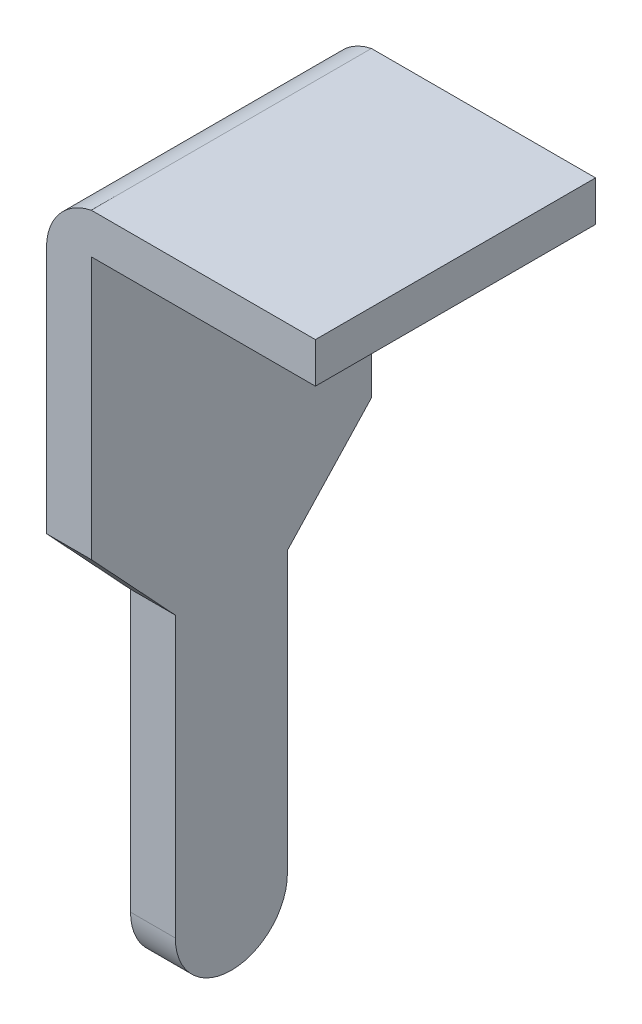
ISO-10303-21;
HEADER;
FILE_DESCRIPTION(('STEP AP214'),'2;1');
FILE_NAME('part.step','',(''),(''),'','','');
FILE_SCHEMA(('AUTOMOTIVE_DESIGN { 1 0 10303 214 1 1 1 1 }'));
ENDSEC;
DATA;
#1=APPLICATION_CONTEXT('core data for automotive mechanical design processes');
#2=APPLICATION_PROTOCOL_DEFINITION('international standard','automotive_design',2000,#1);
#3=PRODUCT_CONTEXT('',#1,'mechanical');
#4=PRODUCT('Part','Part','',(#3));
#5=PRODUCT_RELATED_PRODUCT_CATEGORY('part','',(#4));
#6=PRODUCT_DEFINITION_FORMATION('','',#4);
#7=PRODUCT_DEFINITION_CONTEXT('part definition',#1,'design');
#8=PRODUCT_DEFINITION('design','',#6,#7);
#9=PRODUCT_DEFINITION_SHAPE('','',#8);
#10=(LENGTH_UNIT() NAMED_UNIT(*) SI_UNIT(.MILLI.,.METRE.));
#11=(NAMED_UNIT(*) PLANE_ANGLE_UNIT() SI_UNIT($,.RADIAN.));
#12=(NAMED_UNIT(*) SI_UNIT($,.STERADIAN.) SOLID_ANGLE_UNIT());
#13=UNCERTAINTY_MEASURE_WITH_UNIT(LENGTH_MEASURE(1.E-05),#10,'distance_accuracy_value','');
#14=(GEOMETRIC_REPRESENTATION_CONTEXT(3) GLOBAL_UNCERTAINTY_ASSIGNED_CONTEXT((#13)) GLOBAL_UNIT_ASSIGNED_CONTEXT((#10,
#11,#12)) REPRESENTATION_CONTEXT('',''));
#15=CARTESIAN_POINT('',(0.,0.,0.));
#16=DIRECTION('',(0.,0.,1.));
#17=DIRECTION('',(1.,0.,0.));
#18=AXIS2_PLACEMENT_3D('',#15,#16,#17);
#19=CARTESIAN_POINT('',(-2.5,3.,4.25));
#20=DIRECTION('',(0.,-1.,0.));
#21=DIRECTION('',(0.,0.,-1.));
#22=AXIS2_PLACEMENT_3D('',#19,#20,#21);
#23=PLANE('',#22);
#24=DIRECTION('',(-1.,0.,0.));
#25=VECTOR('',#24,1.);
#26=CARTESIAN_POINT('',(-2.50000000001,3.00000000001,1.75000000001));
#27=LINE('',#26,#25);
#28=CARTESIAN_POINT('',(-2.5,3.,1.75));
#29=VERTEX_POINT('',#28);
#30=CARTESIAN_POINT('',(-4.5,3.,1.75));
#31=VERTEX_POINT('',#30);
#32=EDGE_CURVE('E239',#29,#31,#27,.T.);
#33=ORIENTED_EDGE('',*,*,#32,.T.);
#34=DIRECTION('',(0.,0.,-1.));
#35=VECTOR('',#34,1.);
#36=CARTESIAN_POINT('',(-4.50000000001,3.00000000001,4.25000000001));
#37=LINE('',#36,#35);
#38=CARTESIAN_POINT('',(-4.5,3.,4.25));
#39=VERTEX_POINT('',#38);
#40=EDGE_CURVE('E187',#39,#31,#37,.T.);
#41=ORIENTED_EDGE('',*,*,#40,.F.);
#42=DIRECTION('',(-1.,0.,0.));
#43=VECTOR('',#42,1.);
#44=CARTESIAN_POINT('',(-2.50000000001,3.00000000001,4.25000000001));
#45=LINE('',#44,#43);
#46=CARTESIAN_POINT('',(-2.5,3.,4.25));
#47=VERTEX_POINT('',#46);
#48=EDGE_CURVE('E11',#47,#39,#45,.T.);
#49=ORIENTED_EDGE('',*,*,#48,.F.);
#50=DIRECTION('',(0.,0.,-1.));
#51=VECTOR('',#50,1.);
#52=CARTESIAN_POINT('',(-2.50000000001,3.00000000001,4.25000000001));
#53=LINE('',#52,#51);
#54=EDGE_CURVE('E197',#47,#29,#53,.T.);
#55=ORIENTED_EDGE('',*,*,#54,.T.);
#56=EDGE_LOOP('',(#33,#41,#49,#55));
#57=FACE_BOUND('',#56,.T.);
#58=ADVANCED_FACE('F17',(#57),#23,.F.);
#59=CARTESIAN_POINT('',(4.501,-2.99999999997333,2.9999999999985));
#60=DIRECTION('',(1.,0.,0.));
#61=DIRECTION('',(0.,0.,1.));
#62=AXIS2_PLACEMENT_3D('',#59,#60,#61);
#63=CYLINDRICAL_SURFACE('',#62,0.5);
#64=CARTESIAN_POINT('',(-4.50000000001,-2.99999999998333,3.0000000000085));
#65=DIRECTION('',(-1.,0.,0.));
#66=DIRECTION('',(0.,0.,1.));
#67=AXIS2_PLACEMENT_3D('',#64,#65,#66);
#68=CIRCLE('',#67,0.5);
#69=CARTESIAN_POINT('',(-4.5,-2.99999999997333,2.49999999999849));
#70=VERTEX_POINT('',#69);
#71=CARTESIAN_POINT('',(-4.5,-2.99999999997333,3.4999999999985));
#72=VERTEX_POINT('',#71);
#73=EDGE_CURVE('E136',#70,#72,#68,.T.);
#74=ORIENTED_EDGE('',*,*,#73,.T.);
#75=DIRECTION('',(-1.,0.,0.));
#76=VECTOR('',#75,1.);
#77=CARTESIAN_POINT('',(4.50100000001,-2.99999999998333,3.5000000000085));
#78=LINE('',#77,#76);
#79=CARTESIAN_POINT('',(-4.89999999999981,-2.99999999997333,3.4999999999985));
#80=VERTEX_POINT('',#79);
#81=EDGE_CURVE('E167',#72,#80,#78,.T.);
#82=ORIENTED_EDGE('',*,*,#81,.T.);
#83=CARTESIAN_POINT('',(-4.90000000000981,-2.99999999998333,3.0000000000085));
#84=DIRECTION('',(1.,0.,0.));
#85=DIRECTION('',(0.,0.,1.));
#86=AXIS2_PLACEMENT_3D('',#83,#84,#85);
#87=CIRCLE('',#86,0.5);
#88=CARTESIAN_POINT('',(-4.89999999999981,-2.99999999997333,2.49999999999849));
#89=VERTEX_POINT('',#88);
#90=EDGE_CURVE('E223',#80,#89,#87,.T.);
#91=ORIENTED_EDGE('',*,*,#90,.T.);
#92=DIRECTION('',(-1.,0.,0.));
#93=VECTOR('',#92,1.);
#94=CARTESIAN_POINT('',(4.50100000001,-2.99999999998333,2.50000000000849));
#95=LINE('',#94,#93);
#96=EDGE_CURVE('E182',#70,#89,#95,.T.);
#97=ORIENTED_EDGE('',*,*,#96,.F.);
#98=EDGE_LOOP('',(#74,#82,#91,#97));
#99=FACE_BOUND('',#98,.T.);
#100=ADVANCED_FACE('F213',(#99),#63,.T.);
#101=CARTESIAN_POINT('',(-2.5,2.64,4.25));
#102=DIRECTION('',(0.,1.,0.));
#103=DIRECTION('',(1.,0.,0.));
#104=AXIS2_PLACEMENT_3D('',#101,#102,#103);
#105=PLANE('',#104);
#106=DIRECTION('',(1.,0.,0.));
#107=VECTOR('',#106,1.);
#108=CARTESIAN_POINT('',(-2.50000000001,2.64000000001,1.75000000001));
#109=LINE('',#108,#107);
#110=CARTESIAN_POINT('',(-4.5,2.64,1.75));
#111=VERTEX_POINT('',#110);
#112=CARTESIAN_POINT('',(-2.5,2.64,1.75));
#113=VERTEX_POINT('',#112);
#114=EDGE_CURVE('E84',#111,#113,#109,.T.);
#115=ORIENTED_EDGE('',*,*,#114,.T.);
#116=DIRECTION('',(0.,0.,-1.));
#117=VECTOR('',#116,1.);
#118=CARTESIAN_POINT('',(-2.50000000001,2.64000000001,4.25000000001));
#119=LINE('',#118,#117);
#120=CARTESIAN_POINT('',(-2.5,2.64,4.25));
#121=VERTEX_POINT('',#120);
#122=EDGE_CURVE('E179',#121,#113,#119,.T.);
#123=ORIENTED_EDGE('',*,*,#122,.F.);
#124=DIRECTION('',(1.,0.,0.));
#125=VECTOR('',#124,1.);
#126=CARTESIAN_POINT('',(-2.50000000001,2.64000000001,4.25000000001));
#127=LINE('',#126,#125);
#128=CARTESIAN_POINT('',(-4.5,2.64,4.25));
#129=VERTEX_POINT('',#128);
#130=EDGE_CURVE('E28',#129,#121,#127,.T.);
#131=ORIENTED_EDGE('',*,*,#130,.F.);
#132=DIRECTION('',(0.,0.,-1.));
#133=VECTOR('',#132,1.);
#134=CARTESIAN_POINT('',(-4.50000000001,2.64000000001,4.25000000001));
#135=LINE('',#134,#133);
#136=EDGE_CURVE('E134',#129,#111,#135,.T.);
#137=ORIENTED_EDGE('',*,*,#136,.T.);
#138=EDGE_LOOP('',(#115,#123,#131,#137));
#139=FACE_BOUND('',#138,.T.);
#140=ADVANCED_FACE('F414',(#139),#105,.F.);
#141=CARTESIAN_POINT('',(4.501,0.300000000030073,1.75));
#142=DIRECTION('',(0.,0.681998359841838,0.73135370182494));
#143=DIRECTION('',(1.,0.,0.));
#144=AXIS2_PLACEMENT_3D('',#141,#142,#143);
#145=PLANE('',#144);
#146=DIRECTION('',(0.,-0.73135370182494,0.681998359841838));
#147=VECTOR('',#146,1.);
#148=CARTESIAN_POINT('',(-4.50000000001,0.300000000040073,1.75000000001));
#149=LINE('',#148,#147);
#150=CARTESIAN_POINT('',(-4.5,0.300000000030073,1.75));
#151=VERTEX_POINT('',#150);
#152=CARTESIAN_POINT('',(-4.5,-0.504276532973332,2.49999999999849));
#153=VERTEX_POINT('',#152);
#154=EDGE_CURVE('E191',#151,#153,#149,.T.);
#155=ORIENTED_EDGE('',*,*,#154,.T.);
#156=DIRECTION('',(-1.,0.,0.));
#157=VECTOR('',#156,1.);
#158=CARTESIAN_POINT('',(4.50100000001,-0.504276532983332,2.50000000000849));
#159=LINE('',#158,#157);
#160=CARTESIAN_POINT('',(-4.89999999999981,-0.504276532973332,2.49999999999849));
#161=VERTEX_POINT('',#160);
#162=EDGE_CURVE('E178',#153,#161,#159,.T.);
#163=ORIENTED_EDGE('',*,*,#162,.T.);
#164=DIRECTION('',(0.,0.73135370182494,-0.681998359841838));
#165=VECTOR('',#164,1.);
#166=CARTESIAN_POINT('',(-4.90000000000981,0.300000000040073,1.75000000001));
#167=LINE('',#166,#165);
#168=CARTESIAN_POINT('',(-4.89999999999981,0.300000000030073,1.75));
#169=VERTEX_POINT('',#168);
#170=EDGE_CURVE('E163',#161,#169,#167,.T.);
#171=ORIENTED_EDGE('',*,*,#170,.T.);
#172=DIRECTION('',(-1.,0.,0.));
#173=VECTOR('',#172,1.);
#174=CARTESIAN_POINT('',(4.50100000001,0.300000000040073,1.75000000001));
#175=LINE('',#174,#173);
#176=EDGE_CURVE('E71',#151,#169,#175,.T.);
#177=ORIENTED_EDGE('',*,*,#176,.F.);
#178=EDGE_LOOP('',(#155,#163,#171,#177));
#179=FACE_BOUND('',#178,.T.);
#180=ADVANCED_FACE('F265',(#179),#145,.F.);
#181=CARTESIAN_POINT('',(-4.4,2.51010205144353,4.25));
#182=DIRECTION('',(0.,0.,-1.));
#183=DIRECTION('',(0.,-1.,0.));
#184=AXIS2_PLACEMENT_3D('',#181,#182,#183);
#185=PLANE('',#184);
#186=DIRECTION('',(0.,-1.,0.));
#187=VECTOR('',#186,1.);
#188=CARTESIAN_POINT('',(-4.90000000000981,2.51010205145353,4.25000000001));
#189=LINE('',#188,#187);
#190=CARTESIAN_POINT('',(-4.89999999999981,2.51010205144353,4.25));
#191=VERTEX_POINT('',#190);
#192=CARTESIAN_POINT('',(-4.89999999999981,0.300000000030073,4.24999999999699));
#193=VERTEX_POINT('',#192);
#194=EDGE_CURVE('E142',#191,#193,#189,.T.);
#195=ORIENTED_EDGE('',*,*,#194,.T.);
#196=DIRECTION('',(-1.,0.,0.));
#197=VECTOR('',#196,1.);
#198=CARTESIAN_POINT('',(4.50100000001,0.300000000040073,4.25000000000699));
#199=LINE('',#198,#197);
#200=CARTESIAN_POINT('',(-4.5,0.300000000033306,4.25));
#201=VERTEX_POINT('',#200);
#202=EDGE_CURVE('E139',#201,#193,#199,.T.);
#203=ORIENTED_EDGE('',*,*,#202,.F.);
#204=DIRECTION('',(0.,1.,0.));
#205=VECTOR('',#204,1.);
#206=CARTESIAN_POINT('',(-4.50000000001,-5.20517005876641,4.25000000001));
#207=LINE('',#206,#205);
#208=EDGE_CURVE('E126',#201,#129,#207,.T.);
#209=ORIENTED_EDGE('',*,*,#208,.T.);
#210=ORIENTED_EDGE('',*,*,#130,.T.);
#211=DIRECTION('',(0.,1.,0.));
#212=VECTOR('',#211,1.);
#213=CARTESIAN_POINT('',(-2.50000000001,3.00000000001,4.25000000001));
#214=LINE('',#213,#212);
#215=EDGE_CURVE('E183',#121,#47,#214,.T.);
#216=ORIENTED_EDGE('',*,*,#215,.T.);
#217=ORIENTED_EDGE('',*,*,#48,.T.);
#218=CARTESIAN_POINT('',(-4.40000000000997,2.51010205145353,4.25000000001));
#219=DIRECTION('',(0.,0.,1.));
#220=DIRECTION('',(-1.,0.,0.));
#221=AXIS2_PLACEMENT_3D('',#218,#219,#220);
#222=CIRCLE('',#221,0.5);
#223=EDGE_CURVE('E162',#39,#191,#222,.T.);
#224=ORIENTED_EDGE('',*,*,#223,.T.);
#225=EDGE_LOOP('',(#195,#203,#209,#210,#216,#217,#224));
#226=FACE_BOUND('',#225,.T.);
#227=ADVANCED_FACE('F19',(#226),#185,.F.);
#228=CARTESIAN_POINT('',(4.501,-0.504276532973332,2.49999999999849));
#229=DIRECTION('',(0.,0.,1.));
#230=DIRECTION('',(1.,0.,0.));
#231=AXIS2_PLACEMENT_3D('',#228,#229,#230);
#232=PLANE('',#231);
#233=DIRECTION('',(0.,-1.,0.));
#234=VECTOR('',#233,1.);
#235=CARTESIAN_POINT('',(-4.50000000001,-0.504276532983332,2.50000000000849));
#236=LINE('',#235,#234);
#237=EDGE_CURVE('E171',#153,#70,#236,.T.);
#238=ORIENTED_EDGE('',*,*,#237,.T.);
#239=ORIENTED_EDGE('',*,*,#96,.T.);
#240=DIRECTION('',(0.,1.,0.));
#241=VECTOR('',#240,1.);
#242=CARTESIAN_POINT('',(-4.90000000000981,-0.504276532983332,2.50000000000849));
#243=LINE('',#242,#241);
#244=EDGE_CURVE('E165',#89,#161,#243,.T.);
#245=ORIENTED_EDGE('',*,*,#244,.T.);
#246=ORIENTED_EDGE('',*,*,#162,.F.);
#247=EDGE_LOOP('',(#238,#239,#245,#246));
#248=FACE_BOUND('',#247,.T.);
#249=ADVANCED_FACE('F206',(#248),#232,.F.);
#250=CARTESIAN_POINT('',(-2.5,3.,4.25));
#251=DIRECTION('',(-1.,0.,0.));
#252=DIRECTION('',(0.,0.,1.));
#253=AXIS2_PLACEMENT_3D('',#250,#251,#252);
#254=PLANE('',#253);
#255=DIRECTION('',(0.,1.,0.));
#256=VECTOR('',#255,1.);
#257=CARTESIAN_POINT('',(-2.50000000001,3.00000000001,1.75000000001));
#258=LINE('',#257,#256);
#259=EDGE_CURVE('E235',#113,#29,#258,.T.);
#260=ORIENTED_EDGE('',*,*,#259,.T.);
#261=ORIENTED_EDGE('',*,*,#54,.F.);
#262=ORIENTED_EDGE('',*,*,#215,.F.);
#263=ORIENTED_EDGE('',*,*,#122,.T.);
#264=EDGE_LOOP('',(#260,#261,#262,#263));
#265=FACE_BOUND('',#264,.T.);
#266=ADVANCED_FACE('F406',(#265),#254,.F.);
#267=CARTESIAN_POINT('',(-4.4,2.51010205144353,1.75));
#268=DIRECTION('',(0.,0.,-1.));
#269=DIRECTION('',(0.,-1.,0.));
#270=AXIS2_PLACEMENT_3D('',#267,#268,#269);
#271=PLANE('',#270);
#272=ORIENTED_EDGE('',*,*,#176,.T.);
#273=DIRECTION('',(0.,-1.,0.));
#274=VECTOR('',#273,1.);
#275=CARTESIAN_POINT('',(-4.90000000000981,2.51010205145353,1.75000000001));
#276=LINE('',#275,#274);
#277=CARTESIAN_POINT('',(-4.89999999999981,2.51010205144353,1.75));
#278=VERTEX_POINT('',#277);
#279=EDGE_CURVE('E166',#278,#169,#276,.T.);
#280=ORIENTED_EDGE('',*,*,#279,.F.);
#281=CARTESIAN_POINT('',(-4.40000000000997,2.51010205145353,1.75000000001));
#282=DIRECTION('',(0.,0.,1.));
#283=DIRECTION('',(-1.,0.,0.));
#284=AXIS2_PLACEMENT_3D('',#281,#282,#283);
#285=CIRCLE('',#284,0.5);
#286=EDGE_CURVE('E175',#31,#278,#285,.T.);
#287=ORIENTED_EDGE('',*,*,#286,.F.);
#288=ORIENTED_EDGE('',*,*,#32,.F.);
#289=ORIENTED_EDGE('',*,*,#259,.F.);
#290=ORIENTED_EDGE('',*,*,#114,.F.);
#291=DIRECTION('',(0.,1.,0.));
#292=VECTOR('',#291,1.);
#293=CARTESIAN_POINT('',(-4.50000000001,-5.20517005876641,1.75000000001));
#294=LINE('',#293,#292);
#295=EDGE_CURVE('E194',#151,#111,#294,.T.);
#296=ORIENTED_EDGE('',*,*,#295,.F.);
#297=EDGE_LOOP('',(#272,#280,#287,#288,#289,#290,#296));
#298=FACE_BOUND('',#297,.T.);
#299=ADVANCED_FACE('F269',(#298),#271,.T.);
#300=CARTESIAN_POINT('',(-4.4,2.51010205144353,4.25));
#301=DIRECTION('',(0.,0.,1.));
#302=DIRECTION('',(-1.,0.,0.));
#303=AXIS2_PLACEMENT_3D('',#300,#301,#302);
#304=CYLINDRICAL_SURFACE('',#303,0.5);
#305=ORIENTED_EDGE('',*,*,#286,.T.);
#306=DIRECTION('',(0.,0.,-1.));
#307=VECTOR('',#306,1.);
#308=CARTESIAN_POINT('',(-4.90000000000981,2.51010205145353,4.25000000001));
#309=LINE('',#308,#307);
#310=EDGE_CURVE('E151',#191,#278,#309,.T.);
#311=ORIENTED_EDGE('',*,*,#310,.F.);
#312=ORIENTED_EDGE('',*,*,#223,.F.);
#313=ORIENTED_EDGE('',*,*,#40,.T.);
#314=EDGE_LOOP('',(#305,#311,#312,#313));
#315=FACE_BOUND('',#314,.T.);
#316=ADVANCED_FACE('F275',(#315),#304,.T.);
#317=CARTESIAN_POINT('',(-4.5,-5.20517005875641,4.25));
#318=DIRECTION('',(-1.,0.,0.));
#319=DIRECTION('',(0.,0.,1.));
#320=AXIS2_PLACEMENT_3D('',#317,#318,#319);
#321=PLANE('',#320);
#322=ORIENTED_EDGE('',*,*,#237,.F.);
#323=ORIENTED_EDGE('',*,*,#154,.F.);
#324=ORIENTED_EDGE('',*,*,#295,.T.);
#325=ORIENTED_EDGE('',*,*,#136,.F.);
#326=ORIENTED_EDGE('',*,*,#208,.F.);
#327=DIRECTION('',(0.,0.73135370182494,0.681998359841838));
#328=VECTOR('',#327,1.);
#329=CARTESIAN_POINT('',(-4.50000000001,-0.504276532983332,3.5000000000085));
#330=LINE('',#329,#328);
#331=CARTESIAN_POINT('',(-4.5,-0.504276532973332,3.4999999999985));
#332=VERTEX_POINT('',#331);
#333=EDGE_CURVE('E132',#332,#201,#330,.T.);
#334=ORIENTED_EDGE('',*,*,#333,.F.);
#335=DIRECTION('',(0.,1.,0.));
#336=VECTOR('',#335,1.);
#337=CARTESIAN_POINT('',(-4.50000000001,-2.99999999998333,3.5000000000085));
#338=LINE('',#337,#336);
#339=EDGE_CURVE('E172',#72,#332,#338,.T.);
#340=ORIENTED_EDGE('',*,*,#339,.F.);
#341=ORIENTED_EDGE('',*,*,#73,.F.);
#342=EDGE_LOOP('',(#322,#323,#324,#325,#326,#334,#340,#341));
#343=FACE_BOUND('',#342,.T.);
#344=ADVANCED_FACE('F129',(#343),#321,.F.);
#345=CARTESIAN_POINT('',(4.501,-2.99999999997333,3.4999999999985));
#346=DIRECTION('',(0.,0.,-1.));
#347=DIRECTION('',(0.,-1.,0.));
#348=AXIS2_PLACEMENT_3D('',#345,#346,#347);
#349=PLANE('',#348);
#350=ORIENTED_EDGE('',*,*,#339,.T.);
#351=DIRECTION('',(-1.,0.,0.));
#352=VECTOR('',#351,1.);
#353=CARTESIAN_POINT('',(4.50100000001,-0.504276532983332,3.5000000000085));
#354=LINE('',#353,#352);
#355=CARTESIAN_POINT('',(-4.89999999999981,-0.504276532973332,3.4999999999985));
#356=VERTEX_POINT('',#355);
#357=EDGE_CURVE('E21',#332,#356,#354,.T.);
#358=ORIENTED_EDGE('',*,*,#357,.T.);
#359=DIRECTION('',(0.,-1.,0.));
#360=VECTOR('',#359,1.);
#361=CARTESIAN_POINT('',(-4.90000000000981,-2.99999999998333,3.5000000000085));
#362=LINE('',#361,#360);
#363=EDGE_CURVE('E218',#356,#80,#362,.T.);
#364=ORIENTED_EDGE('',*,*,#363,.T.);
#365=ORIENTED_EDGE('',*,*,#81,.F.);
#366=EDGE_LOOP('',(#350,#358,#364,#365));
#367=FACE_BOUND('',#366,.T.);
#368=ADVANCED_FACE('F216',(#367),#349,.F.);
#369=CARTESIAN_POINT('',(4.501,-0.504276532973332,3.4999999999985));
#370=DIRECTION('',(0.,0.681998359841838,-0.73135370182494));
#371=DIRECTION('',(-1.,0.,0.));
#372=AXIS2_PLACEMENT_3D('',#369,#370,#371);
#373=PLANE('',#372);
#374=ORIENTED_EDGE('',*,*,#333,.T.);
#375=ORIENTED_EDGE('',*,*,#202,.T.);
#376=DIRECTION('',(0.,-0.73135370182494,-0.681998359841838));
#377=VECTOR('',#376,1.);
#378=CARTESIAN_POINT('',(-4.90000000000981,-0.504276532983332,3.5000000000085));
#379=LINE('',#378,#377);
#380=EDGE_CURVE('E222',#193,#356,#379,.T.);
#381=ORIENTED_EDGE('',*,*,#380,.T.);
#382=ORIENTED_EDGE('',*,*,#357,.F.);
#383=EDGE_LOOP('',(#374,#375,#381,#382));
#384=FACE_BOUND('',#383,.T.);
#385=ADVANCED_FACE('F149',(#384),#373,.F.);
#386=CARTESIAN_POINT('',(-4.89999999999981,2.51010205144353,4.25));
#387=DIRECTION('',(1.,0.,0.));
#388=DIRECTION('',(0.,1.,0.));
#389=AXIS2_PLACEMENT_3D('',#386,#387,#388);
#390=PLANE('',#389);
#391=ORIENTED_EDGE('',*,*,#279,.T.);
#392=ORIENTED_EDGE('',*,*,#170,.F.);
#393=ORIENTED_EDGE('',*,*,#244,.F.);
#394=ORIENTED_EDGE('',*,*,#90,.F.);
#395=ORIENTED_EDGE('',*,*,#363,.F.);
#396=ORIENTED_EDGE('',*,*,#380,.F.);
#397=ORIENTED_EDGE('',*,*,#194,.F.);
#398=ORIENTED_EDGE('',*,*,#310,.T.);
#399=EDGE_LOOP('',(#391,#392,#393,#394,#395,#396,#397,#398));
#400=FACE_BOUND('',#399,.T.);
#401=ADVANCED_FACE('F226',(#400),#390,.F.);
#402=CLOSED_SHELL('',(#58,#100,#140,#180,#227,#249,#266,#299,#316,#344,#368,#385,#401));
#403=MANIFOLD_SOLID_BREP('B1',#402);
#404=ADVANCED_BREP_SHAPE_REPRESENTATION('',(#18,#403),#14);
#405=SHAPE_DEFINITION_REPRESENTATION(#9,#404);
ENDSEC;
END-ISO-10303-21;
